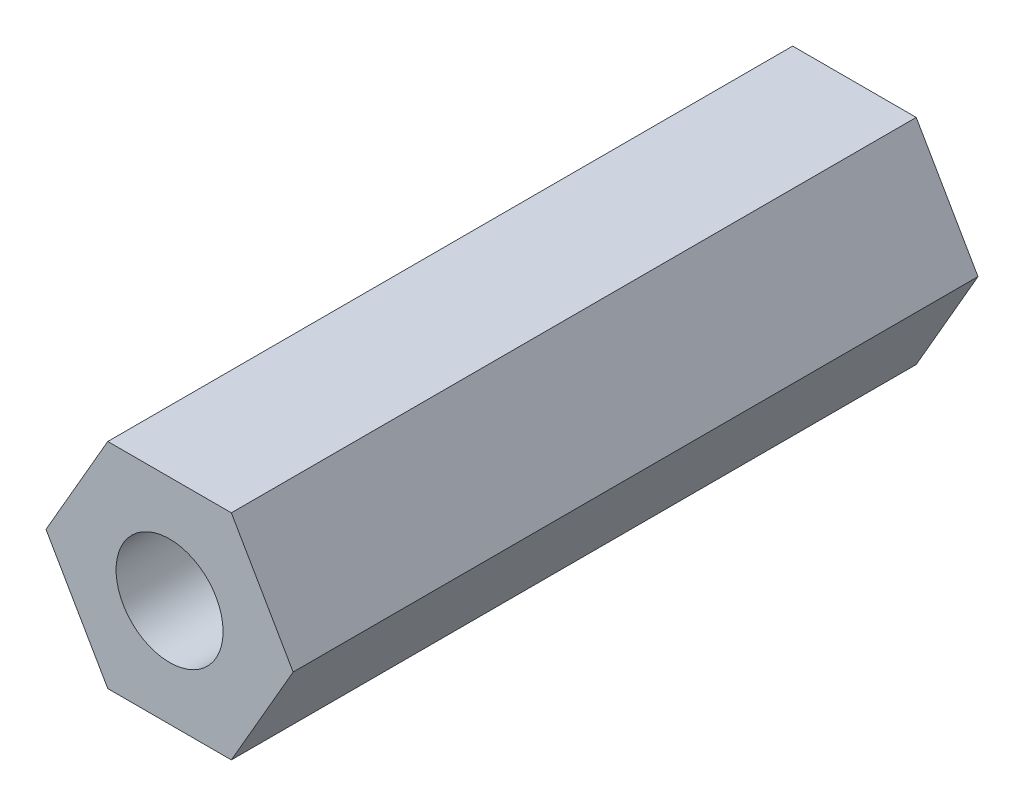
ISO-10303-21;
HEADER;
FILE_DESCRIPTION(('STEP AP214'),'2;1');
FILE_NAME('part.step','',(''),(''),'','','');
FILE_SCHEMA(('AUTOMOTIVE_DESIGN { 1 0 10303 214 1 1 1 1 }'));
ENDSEC;
DATA;
#1=APPLICATION_CONTEXT('core data for automotive mechanical design processes');
#2=APPLICATION_PROTOCOL_DEFINITION('international standard','automotive_design',2000,#1);
#3=PRODUCT_CONTEXT('',#1,'mechanical');
#4=PRODUCT('Part','Part','',(#3));
#5=PRODUCT_RELATED_PRODUCT_CATEGORY('part','',(#4));
#6=PRODUCT_DEFINITION_FORMATION('','',#4);
#7=PRODUCT_DEFINITION_CONTEXT('part definition',#1,'design');
#8=PRODUCT_DEFINITION('design','',#6,#7);
#9=PRODUCT_DEFINITION_SHAPE('','',#8);
#10=(LENGTH_UNIT() NAMED_UNIT(*) SI_UNIT(.MILLI.,.METRE.));
#11=(NAMED_UNIT(*) PLANE_ANGLE_UNIT() SI_UNIT($,.RADIAN.));
#12=(NAMED_UNIT(*) SI_UNIT($,.STERADIAN.) SOLID_ANGLE_UNIT());
#13=UNCERTAINTY_MEASURE_WITH_UNIT(LENGTH_MEASURE(1.E-05),#10,'distance_accuracy_value','');
#14=(GEOMETRIC_REPRESENTATION_CONTEXT(3) GLOBAL_UNCERTAINTY_ASSIGNED_CONTEXT((#13)) GLOBAL_UNIT_ASSIGNED_CONTEXT((#10,
#11,#12)) REPRESENTATION_CONTEXT('',''));
#15=CARTESIAN_POINT('',(0.,0.,0.));
#16=DIRECTION('',(0.,0.,1.));
#17=DIRECTION('',(1.,0.,0.));
#18=AXIS2_PLACEMENT_3D('',#15,#16,#17);
#19=CARTESIAN_POINT('',(0.,0.,16.));
#20=DIRECTION('',(0.,0.,1.));
#21=DIRECTION('',(1.,0.,0.));
#22=AXIS2_PLACEMENT_3D('',#19,#20,#21);
#23=PLANE('',#22);
#24=DIRECTION('',(0.5,0.866025403784439,0.));
#25=VECTOR('',#24,1.);
#26=CARTESIAN_POINT('',(1.44337567297406,-2.50000000000002,16.));
#27=LINE('',#26,#25);
#28=CARTESIAN_POINT('',(1.44337567297406,-2.50000000000002,16.));
#29=VERTEX_POINT('',#28);
#30=CARTESIAN_POINT('',(2.88675134594813,0.,16.));
#31=VERTEX_POINT('',#30);
#32=EDGE_CURVE('E130',#29,#31,#27,.T.);
#33=ORIENTED_EDGE('',*,*,#32,.T.);
#34=DIRECTION('',(-0.5,0.866025403784438,0.));
#35=VECTOR('',#34,1.);
#36=CARTESIAN_POINT('',(2.88675134594813,0.,16.));
#37=LINE('',#36,#35);
#38=CARTESIAN_POINT('',(1.44337567297405,2.50000000000002,16.));
#39=VERTEX_POINT('',#38);
#40=EDGE_CURVE('E88',#31,#39,#37,.T.);
#41=ORIENTED_EDGE('',*,*,#40,.T.);
#42=DIRECTION('',(-1.,0.,0.));
#43=VECTOR('',#42,1.);
#44=CARTESIAN_POINT('',(1.44337567297405,2.50000000000002,16.));
#45=LINE('',#44,#43);
#46=CARTESIAN_POINT('',(-1.44337567297407,2.50000000000002,16.));
#47=VERTEX_POINT('',#46);
#48=EDGE_CURVE('E101',#39,#47,#45,.T.);
#49=ORIENTED_EDGE('',*,*,#48,.T.);
#50=DIRECTION('',(-0.500000000000001,-0.866025403784438,0.));
#51=VECTOR('',#50,1.);
#52=CARTESIAN_POINT('',(-1.44337567297407,2.50000000000002,16.));
#53=LINE('',#52,#51);
#54=CARTESIAN_POINT('',(-2.88675134594815,0.,16.));
#55=VERTEX_POINT('',#54);
#56=EDGE_CURVE('E95',#47,#55,#53,.T.);
#57=ORIENTED_EDGE('',*,*,#56,.T.);
#58=DIRECTION('',(0.5,-0.866025403784439,0.));
#59=VECTOR('',#58,1.);
#60=CARTESIAN_POINT('',(-2.88675134594815,0.,16.));
#61=LINE('',#60,#59);
#62=CARTESIAN_POINT('',(-1.44337567297407,-2.50000000000001,16.));
#63=VERTEX_POINT('',#62);
#64=EDGE_CURVE('E99',#55,#63,#61,.T.);
#65=ORIENTED_EDGE('',*,*,#64,.T.);
#66=DIRECTION('',(1.,0.,0.));
#67=VECTOR('',#66,1.);
#68=CARTESIAN_POINT('',(-1.44337567297407,-2.50000000000001,16.));
#69=LINE('',#68,#67);
#70=EDGE_CURVE('E51',#63,#29,#69,.T.);
#71=ORIENTED_EDGE('',*,*,#70,.T.);
#72=EDGE_LOOP('',(#33,#41,#49,#57,#65,#71));
#73=FACE_BOUND('',#72,.T.);
#74=CARTESIAN_POINT('',(0.,0.,16.));
#75=DIRECTION('',(0.,0.,1.));
#76=DIRECTION('',(1.,0.,0.));
#77=AXIS2_PLACEMENT_3D('',#74,#75,#76);
#78=CIRCLE('',#77,1.25);
#79=CARTESIAN_POINT('',(1.25,0.,16.));
#80=VERTEX_POINT('',#79);
#81=EDGE_CURVE('E123',#80,#80,#78,.T.);
#82=ORIENTED_EDGE('',*,*,#81,.F.);
#83=EDGE_LOOP('',(#82));
#84=FACE_BOUND('',#83,.T.);
#85=ADVANCED_FACE('F34',(#73,#84),#23,.T.);
#86=CARTESIAN_POINT('',(0.,0.,0.));
#87=DIRECTION('',(0.,0.,1.));
#88=DIRECTION('',(1.,0.,0.));
#89=AXIS2_PLACEMENT_3D('',#86,#87,#88);
#90=PLANE('',#89);
#91=DIRECTION('',(0.5,0.866025403784439,0.));
#92=VECTOR('',#91,1.);
#93=CARTESIAN_POINT('',(1.44337567297406,-2.50000000000002,0.));
#94=LINE('',#93,#92);
#95=CARTESIAN_POINT('',(1.44337567297406,-2.50000000000002,0.));
#96=VERTEX_POINT('',#95);
#97=CARTESIAN_POINT('',(2.88675134594813,0.,0.));
#98=VERTEX_POINT('',#97);
#99=EDGE_CURVE('E119',#96,#98,#94,.T.);
#100=ORIENTED_EDGE('',*,*,#99,.F.);
#101=DIRECTION('',(1.,0.,0.));
#102=VECTOR('',#101,1.);
#103=CARTESIAN_POINT('',(-1.44337567297407,-2.50000000000001,0.));
#104=LINE('',#103,#102);
#105=CARTESIAN_POINT('',(-1.44337567297407,-2.50000000000001,0.));
#106=VERTEX_POINT('',#105);
#107=EDGE_CURVE('E80',#106,#96,#104,.T.);
#108=ORIENTED_EDGE('',*,*,#107,.F.);
#109=DIRECTION('',(0.5,-0.866025403784439,0.));
#110=VECTOR('',#109,1.);
#111=CARTESIAN_POINT('',(-2.88675134594815,0.,0.));
#112=LINE('',#111,#110);
#113=CARTESIAN_POINT('',(-2.88675134594815,0.,0.));
#114=VERTEX_POINT('',#113);
#115=EDGE_CURVE('E74',#114,#106,#112,.T.);
#116=ORIENTED_EDGE('',*,*,#115,.F.);
#117=DIRECTION('',(-0.500000000000001,-0.866025403784438,0.));
#118=VECTOR('',#117,1.);
#119=CARTESIAN_POINT('',(-1.44337567297407,2.50000000000002,0.));
#120=LINE('',#119,#118);
#121=CARTESIAN_POINT('',(-1.44337567297407,2.50000000000002,0.));
#122=VERTEX_POINT('',#121);
#123=EDGE_CURVE('E109',#122,#114,#120,.T.);
#124=ORIENTED_EDGE('',*,*,#123,.F.);
#125=DIRECTION('',(-1.,0.,0.));
#126=VECTOR('',#125,1.);
#127=CARTESIAN_POINT('',(1.44337567297405,2.50000000000002,0.));
#128=LINE('',#127,#126);
#129=CARTESIAN_POINT('',(1.44337567297405,2.50000000000002,0.));
#130=VERTEX_POINT('',#129);
#131=EDGE_CURVE('E125',#130,#122,#128,.T.);
#132=ORIENTED_EDGE('',*,*,#131,.F.);
#133=DIRECTION('',(-0.5,0.866025403784438,0.));
#134=VECTOR('',#133,1.);
#135=CARTESIAN_POINT('',(2.88675134594813,0.,0.));
#136=LINE('',#135,#134);
#137=EDGE_CURVE('E122',#98,#130,#136,.T.);
#138=ORIENTED_EDGE('',*,*,#137,.F.);
#139=EDGE_LOOP('',(#100,#108,#116,#124,#132,#138));
#140=FACE_BOUND('',#139,.T.);
#141=CARTESIAN_POINT('',(0.,0.,0.));
#142=DIRECTION('',(0.,0.,1.));
#143=DIRECTION('',(1.,0.,0.));
#144=AXIS2_PLACEMENT_3D('',#141,#142,#143);
#145=CIRCLE('',#144,1.25);
#146=CARTESIAN_POINT('',(1.25,0.,0.));
#147=VERTEX_POINT('',#146);
#148=EDGE_CURVE('E223',#147,#147,#145,.T.);
#149=ORIENTED_EDGE('',*,*,#148,.T.);
#150=EDGE_LOOP('',(#149));
#151=FACE_BOUND('',#150,.T.);
#152=ADVANCED_FACE('F139',(#140,#151),#90,.F.);
#153=CARTESIAN_POINT('',(1.44337567297406,-2.50000000000002,16.));
#154=DIRECTION('',(-0.866025403784439,0.5,0.));
#155=DIRECTION('',(-0.5,-0.866025403784439,0.));
#156=AXIS2_PLACEMENT_3D('',#153,#154,#155);
#157=PLANE('',#156);
#158=ORIENTED_EDGE('',*,*,#99,.T.);
#159=DIRECTION('',(0.,0.,-1.));
#160=VECTOR('',#159,1.);
#161=CARTESIAN_POINT('',(2.88675134594813,0.,16.));
#162=LINE('',#161,#160);
#163=EDGE_CURVE('E11',#31,#98,#162,.T.);
#164=ORIENTED_EDGE('',*,*,#163,.F.);
#165=ORIENTED_EDGE('',*,*,#32,.F.);
#166=DIRECTION('',(0.,0.,-1.));
#167=VECTOR('',#166,1.);
#168=CARTESIAN_POINT('',(1.44337567297406,-2.50000000000002,16.));
#169=LINE('',#168,#167);
#170=EDGE_CURVE('E115',#29,#96,#169,.T.);
#171=ORIENTED_EDGE('',*,*,#170,.T.);
#172=EDGE_LOOP('',(#158,#164,#165,#171));
#173=FACE_BOUND('',#172,.T.);
#174=ADVANCED_FACE('F36',(#173),#157,.F.);
#175=CARTESIAN_POINT('',(2.88675134594813,0.,16.));
#176=DIRECTION('',(-0.866025403784438,-0.5,0.));
#177=DIRECTION('',(0.5,-0.866025403784438,0.));
#178=AXIS2_PLACEMENT_3D('',#175,#176,#177);
#179=PLANE('',#178);
#180=ORIENTED_EDGE('',*,*,#137,.T.);
#181=DIRECTION('',(0.,0.,-1.));
#182=VECTOR('',#181,1.);
#183=CARTESIAN_POINT('',(1.44337567297405,2.50000000000002,16.));
#184=LINE('',#183,#182);
#185=EDGE_CURVE('E43',#39,#130,#184,.T.);
#186=ORIENTED_EDGE('',*,*,#185,.F.);
#187=ORIENTED_EDGE('',*,*,#40,.F.);
#188=ORIENTED_EDGE('',*,*,#163,.T.);
#189=EDGE_LOOP('',(#180,#186,#187,#188));
#190=FACE_BOUND('',#189,.T.);
#191=ADVANCED_FACE('F164',(#190),#179,.F.);
#192=CARTESIAN_POINT('',(1.44337567297405,2.50000000000002,16.));
#193=DIRECTION('',(0.,-1.,0.));
#194=DIRECTION('',(0.,0.,-1.));
#195=AXIS2_PLACEMENT_3D('',#192,#193,#194);
#196=PLANE('',#195);
#197=ORIENTED_EDGE('',*,*,#131,.T.);
#198=DIRECTION('',(0.,0.,-1.));
#199=VECTOR('',#198,1.);
#200=CARTESIAN_POINT('',(-1.44337567297407,2.50000000000002,16.));
#201=LINE('',#200,#199);
#202=EDGE_CURVE('E110',#47,#122,#201,.T.);
#203=ORIENTED_EDGE('',*,*,#202,.F.);
#204=ORIENTED_EDGE('',*,*,#48,.F.);
#205=ORIENTED_EDGE('',*,*,#185,.T.);
#206=EDGE_LOOP('',(#197,#203,#204,#205));
#207=FACE_BOUND('',#206,.T.);
#208=ADVANCED_FACE('F136',(#207),#196,.F.);
#209=CARTESIAN_POINT('',(-1.44337567297407,2.50000000000002,16.));
#210=DIRECTION('',(0.866025403784438,-0.500000000000001,0.));
#211=DIRECTION('',(0.500000000000001,0.866025403784438,0.));
#212=AXIS2_PLACEMENT_3D('',#209,#210,#211);
#213=PLANE('',#212);
#214=ORIENTED_EDGE('',*,*,#123,.T.);
#215=DIRECTION('',(0.,0.,-1.));
#216=VECTOR('',#215,1.);
#217=CARTESIAN_POINT('',(-2.88675134594815,0.,16.));
#218=LINE('',#217,#216);
#219=EDGE_CURVE('E106',#55,#114,#218,.T.);
#220=ORIENTED_EDGE('',*,*,#219,.F.);
#221=ORIENTED_EDGE('',*,*,#56,.F.);
#222=ORIENTED_EDGE('',*,*,#202,.T.);
#223=EDGE_LOOP('',(#214,#220,#221,#222));
#224=FACE_BOUND('',#223,.T.);
#225=ADVANCED_FACE('F107',(#224),#213,.F.);
#226=CARTESIAN_POINT('',(-2.88675134594815,0.,16.));
#227=DIRECTION('',(0.866025403784439,0.5,0.));
#228=DIRECTION('',(-0.5,0.866025403784439,0.));
#229=AXIS2_PLACEMENT_3D('',#226,#227,#228);
#230=PLANE('',#229);
#231=ORIENTED_EDGE('',*,*,#115,.T.);
#232=DIRECTION('',(0.,0.,-1.));
#233=VECTOR('',#232,1.);
#234=CARTESIAN_POINT('',(-1.44337567297407,-2.50000000000001,16.));
#235=LINE('',#234,#233);
#236=EDGE_CURVE('E111',#63,#106,#235,.T.);
#237=ORIENTED_EDGE('',*,*,#236,.F.);
#238=ORIENTED_EDGE('',*,*,#64,.F.);
#239=ORIENTED_EDGE('',*,*,#219,.T.);
#240=EDGE_LOOP('',(#231,#237,#238,#239));
#241=FACE_BOUND('',#240,.T.);
#242=ADVANCED_FACE('F113',(#241),#230,.F.);
#243=CARTESIAN_POINT('',(-1.44337567297407,-2.50000000000001,16.));
#244=DIRECTION('',(0.,1.,0.));
#245=DIRECTION('',(-1.,0.,0.));
#246=AXIS2_PLACEMENT_3D('',#243,#244,#245);
#247=PLANE('',#246);
#248=ORIENTED_EDGE('',*,*,#107,.T.);
#249=ORIENTED_EDGE('',*,*,#170,.F.);
#250=ORIENTED_EDGE('',*,*,#70,.F.);
#251=ORIENTED_EDGE('',*,*,#236,.T.);
#252=EDGE_LOOP('',(#248,#249,#250,#251));
#253=FACE_BOUND('',#252,.T.);
#254=ADVANCED_FACE('F144',(#253),#247,.F.);
#255=CARTESIAN_POINT('',(0.,0.,16.));
#256=DIRECTION('',(0.,0.,-1.));
#257=DIRECTION('',(-1.,0.,0.));
#258=AXIS2_PLACEMENT_3D('',#255,#256,#257);
#259=CYLINDRICAL_SURFACE('',#258,1.25);
#260=ORIENTED_EDGE('',*,*,#81,.T.);
#261=EDGE_LOOP('',(#260));
#262=FACE_BOUND('',#261,.T.);
#263=ORIENTED_EDGE('',*,*,#148,.F.);
#264=EDGE_LOOP('',(#263));
#265=FACE_BOUND('',#264,.T.);
#266=ADVANCED_FACE('F146',(#262,#265),#259,.F.);
#267=CLOSED_SHELL('',(#85,#152,#174,#191,#208,#225,#242,#254,#266));
#268=MANIFOLD_SOLID_BREP('B2',#267);
#269=ADVANCED_BREP_SHAPE_REPRESENTATION('',(#18,#268),#14);
#270=SHAPE_DEFINITION_REPRESENTATION(#9,#269);
ENDSEC;
END-ISO-10303-21;
